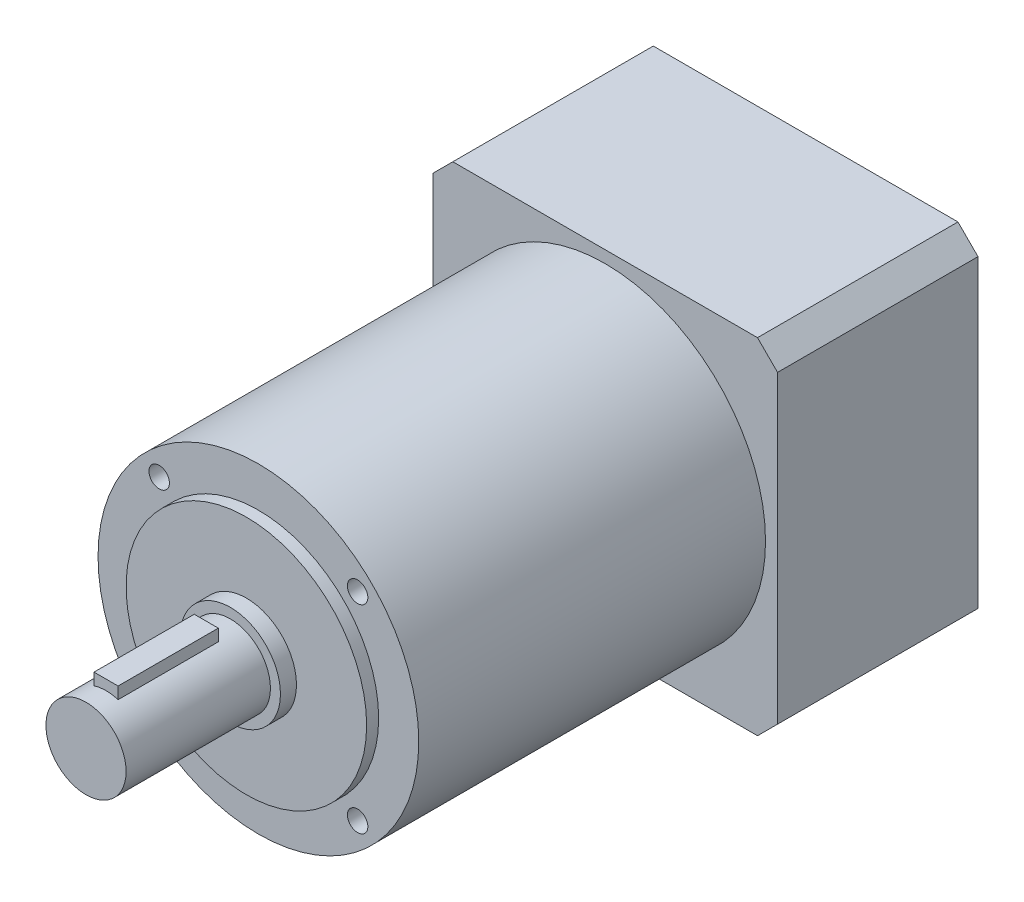
ISO-10303-21;
HEADER;
FILE_DESCRIPTION(('STEP AP214'),'2;1');
FILE_NAME('part.step','',(''),(''),'','','');
FILE_SCHEMA(('AUTOMOTIVE_DESIGN { 1 0 10303 214 1 1 1 1 }'));
ENDSEC;
DATA;
#1=APPLICATION_CONTEXT('core data for automotive mechanical design processes');
#2=APPLICATION_PROTOCOL_DEFINITION('international standard','automotive_design',2000,#1);
#3=PRODUCT_CONTEXT('',#1,'mechanical');
#4=PRODUCT('Part','Part','',(#3));
#5=PRODUCT_RELATED_PRODUCT_CATEGORY('part','',(#4));
#6=PRODUCT_DEFINITION_FORMATION('','',#4);
#7=PRODUCT_DEFINITION_CONTEXT('part definition',#1,'design');
#8=PRODUCT_DEFINITION('design','',#6,#7);
#9=PRODUCT_DEFINITION_SHAPE('','',#8);
#10=(LENGTH_UNIT() NAMED_UNIT(*) SI_UNIT(.MILLI.,.METRE.));
#11=(NAMED_UNIT(*) PLANE_ANGLE_UNIT() SI_UNIT($,.RADIAN.));
#12=(NAMED_UNIT(*) SI_UNIT($,.STERADIAN.) SOLID_ANGLE_UNIT());
#13=UNCERTAINTY_MEASURE_WITH_UNIT(LENGTH_MEASURE(1.E-05),#10,'distance_accuracy_value','');
#14=(GEOMETRIC_REPRESENTATION_CONTEXT(3) GLOBAL_UNCERTAINTY_ASSIGNED_CONTEXT((#13)) GLOBAL_UNIT_ASSIGNED_CONTEXT((#10,
#11,#12)) REPRESENTATION_CONTEXT('',''));
#15=CARTESIAN_POINT('',(0.,0.,0.));
#16=DIRECTION('',(0.,0.,1.));
#17=DIRECTION('',(1.,0.,0.));
#18=AXIS2_PLACEMENT_3D('',#15,#16,#17);
#19=CARTESIAN_POINT('',(0.,0.,179.5));
#20=DIRECTION('',(0.,0.,-1.));
#21=DIRECTION('',(-1.,0.,0.));
#22=AXIS2_PLACEMENT_3D('',#19,#20,#21);
#23=CYLINDRICAL_SURFACE('',#22,10.);
#24=CARTESIAN_POINT('',(0.,0.,143.5));
#25=DIRECTION('',(0.,0.,1.));
#26=DIRECTION('',(1.,0.,0.));
#27=AXIS2_PLACEMENT_3D('',#24,#25,#26);
#28=CIRCLE('',#27,10.);
#29=CARTESIAN_POINT('',(10.,0.,143.5));
#30=VERTEX_POINT('',#29);
#31=EDGE_CURVE('E149',#30,#30,#28,.T.);
#32=ORIENTED_EDGE('',*,*,#31,.T.);
#33=EDGE_LOOP('',(#32));
#34=FACE_BOUND('',#33,.T.);
#35=CARTESIAN_POINT('',(0.,0.,179.5));
#36=DIRECTION('',(0.,0.,1.));
#37=DIRECTION('',(1.,0.,0.));
#38=AXIS2_PLACEMENT_3D('',#35,#36,#37);
#39=CIRCLE('',#38,10.);
#40=CARTESIAN_POINT('',(10.,0.,179.5));
#41=VERTEX_POINT('',#40);
#42=EDGE_CURVE('E152',#41,#41,#39,.T.);
#43=ORIENTED_EDGE('',*,*,#42,.F.);
#44=EDGE_LOOP('',(#43));
#45=FACE_BOUND('',#44,.T.);
#46=DIRECTION('',(0.,0.,-1.));
#47=VECTOR('',#46,1.);
#48=CARTESIAN_POINT('',(-3.,9.53939201416946,179.5));
#49=LINE('',#48,#47);
#50=CARTESIAN_POINT('',(-3.,9.53939201416946,149.5));
#51=VERTEX_POINT('',#50);
#52=CARTESIAN_POINT('',(-3.,9.53939201416946,174.5));
#53=VERTEX_POINT('',#52);
#54=EDGE_CURVE('E148',#51,#53,#49,.F.);
#55=ORIENTED_EDGE('',*,*,#54,.F.);
#56=CARTESIAN_POINT('',(0.,0.,149.5));
#57=DIRECTION('',(0.,0.,1.));
#58=DIRECTION('',(1.,0.,0.));
#59=AXIS2_PLACEMENT_3D('',#56,#57,#58);
#60=CIRCLE('',#59,10.);
#61=CARTESIAN_POINT('',(3.,9.53939201416946,149.5));
#62=VERTEX_POINT('',#61);
#63=EDGE_CURVE('E190',#62,#51,#60,.T.);
#64=ORIENTED_EDGE('',*,*,#63,.F.);
#65=DIRECTION('',(0.,0.,-1.));
#66=VECTOR('',#65,1.);
#67=CARTESIAN_POINT('',(3.,9.53939201416946,179.5));
#68=LINE('',#67,#66);
#69=CARTESIAN_POINT('',(3.,9.53939201416946,174.5));
#70=VERTEX_POINT('',#69);
#71=EDGE_CURVE('E202',#70,#62,#68,.T.);
#72=ORIENTED_EDGE('',*,*,#71,.F.);
#73=CARTESIAN_POINT('',(0.,0.,174.5));
#74=DIRECTION('',(0.,0.,-1.));
#75=DIRECTION('',(-1.,0.,0.));
#76=AXIS2_PLACEMENT_3D('',#73,#74,#75);
#77=CIRCLE('',#76,10.);
#78=EDGE_CURVE('E205',#53,#70,#77,.T.);
#79=ORIENTED_EDGE('',*,*,#78,.F.);
#80=EDGE_LOOP('',(#55,#64,#72,#79));
#81=FACE_BOUND('',#80,.T.);
#82=ADVANCED_FACE('F34',(#34,#45,#81),#23,.T.);
#83=CARTESIAN_POINT('',(0.,0.,143.5));
#84=DIRECTION('',(0.,0.,1.));
#85=DIRECTION('',(1.,0.,0.));
#86=AXIS2_PLACEMENT_3D('',#83,#84,#85);
#87=PLANE('',#86);
#88=CARTESIAN_POINT('',(0.,0.,143.5));
#89=DIRECTION('',(0.,0.,1.));
#90=DIRECTION('',(1.,0.,0.));
#91=AXIS2_PLACEMENT_3D('',#88,#89,#90);
#92=CIRCLE('',#91,12.5);
#93=CARTESIAN_POINT('',(12.5,0.,143.5));
#94=VERTEX_POINT('',#93);
#95=EDGE_CURVE('E161',#94,#94,#92,.T.);
#96=ORIENTED_EDGE('',*,*,#95,.T.);
#97=EDGE_LOOP('',(#96));
#98=FACE_BOUND('',#97,.T.);
#99=ORIENTED_EDGE('',*,*,#31,.F.);
#100=EDGE_LOOP('',(#99));
#101=FACE_BOUND('',#100,.T.);
#102=ADVANCED_FACE('F282',(#98,#101),#87,.T.);
#103=CARTESIAN_POINT('',(0.,0.,139.5));
#104=DIRECTION('',(0.,0.,1.));
#105=DIRECTION('',(1.,0.,0.));
#106=AXIS2_PLACEMENT_3D('',#103,#104,#105);
#107=PLANE('',#106);
#108=CARTESIAN_POINT('',(0.,0.,139.5));
#109=DIRECTION('',(0.,0.,1.));
#110=DIRECTION('',(1.,0.,0.));
#111=AXIS2_PLACEMENT_3D('',#108,#109,#110);
#112=CIRCLE('',#111,30.);
#113=CARTESIAN_POINT('',(30.,0.,139.5));
#114=VERTEX_POINT('',#113);
#115=EDGE_CURVE('E167',#114,#114,#112,.T.);
#116=ORIENTED_EDGE('',*,*,#115,.T.);
#117=EDGE_LOOP('',(#116));
#118=FACE_BOUND('',#117,.T.);
#119=CARTESIAN_POINT('',(0.,0.,139.5));
#120=DIRECTION('',(0.,0.,1.));
#121=DIRECTION('',(1.,0.,0.));
#122=AXIS2_PLACEMENT_3D('',#119,#120,#121);
#123=CIRCLE('',#122,12.5);
#124=CARTESIAN_POINT('',(12.5,0.,139.5));
#125=VERTEX_POINT('',#124);
#126=EDGE_CURVE('E159',#125,#125,#123,.T.);
#127=ORIENTED_EDGE('',*,*,#126,.F.);
#128=EDGE_LOOP('',(#127));
#129=FACE_BOUND('',#128,.T.);
#130=ADVANCED_FACE('F288',(#118,#129),#107,.T.);
#131=CARTESIAN_POINT('',(0.,0.,136.5));
#132=DIRECTION('',(0.,0.,1.));
#133=DIRECTION('',(1.,0.,0.));
#134=AXIS2_PLACEMENT_3D('',#131,#132,#133);
#135=PLANE('',#134);
#136=CARTESIAN_POINT('',(-24.7487373415292,-24.7487373415292,136.5));
#137=DIRECTION('',(0.,0.,1.));
#138=DIRECTION('',(1.,0.,0.));
#139=AXIS2_PLACEMENT_3D('',#136,#137,#138);
#140=CIRCLE('',#139,2.55);
#141=CARTESIAN_POINT('',(-22.1987373415292,-24.7487373415292,136.5));
#142=VERTEX_POINT('',#141);
#143=EDGE_CURVE('E561',#142,#142,#140,.T.);
#144=ORIENTED_EDGE('',*,*,#143,.F.);
#145=EDGE_LOOP('',(#144));
#146=FACE_BOUND('',#145,.T.);
#147=CARTESIAN_POINT('',(24.7487373415292,-24.7487373415292,136.5));
#148=DIRECTION('',(0.,0.,1.));
#149=DIRECTION('',(1.,0.,0.));
#150=AXIS2_PLACEMENT_3D('',#147,#148,#149);
#151=CIRCLE('',#150,2.55);
#152=CARTESIAN_POINT('',(27.2987373415292,-24.7487373415292,136.5));
#153=VERTEX_POINT('',#152);
#154=EDGE_CURVE('E555',#153,#153,#151,.T.);
#155=ORIENTED_EDGE('',*,*,#154,.F.);
#156=EDGE_LOOP('',(#155));
#157=FACE_BOUND('',#156,.T.);
#158=CARTESIAN_POINT('',(24.7487373415292,24.7487373415292,136.5));
#159=DIRECTION('',(0.,0.,1.));
#160=DIRECTION('',(1.,0.,0.));
#161=AXIS2_PLACEMENT_3D('',#158,#159,#160);
#162=CIRCLE('',#161,2.55);
#163=CARTESIAN_POINT('',(27.2987373415292,24.7487373415292,136.5));
#164=VERTEX_POINT('',#163);
#165=EDGE_CURVE('E549',#164,#164,#162,.T.);
#166=ORIENTED_EDGE('',*,*,#165,.F.);
#167=EDGE_LOOP('',(#166));
#168=FACE_BOUND('',#167,.T.);
#169=CARTESIAN_POINT('',(-24.7487373415292,24.7487373415292,136.5));
#170=DIRECTION('',(0.,0.,1.));
#171=DIRECTION('',(1.,0.,0.));
#172=AXIS2_PLACEMENT_3D('',#169,#170,#171);
#173=CIRCLE('',#172,2.55);
#174=CARTESIAN_POINT('',(-22.1987373415292,24.7487373415292,136.5));
#175=VERTEX_POINT('',#174);
#176=EDGE_CURVE('E543',#175,#175,#173,.T.);
#177=ORIENTED_EDGE('',*,*,#176,.F.);
#178=EDGE_LOOP('',(#177));
#179=FACE_BOUND('',#178,.T.);
#180=CARTESIAN_POINT('',(0.,0.,136.5));
#181=DIRECTION('',(0.,0.,1.));
#182=DIRECTION('',(1.,0.,0.));
#183=AXIS2_PLACEMENT_3D('',#180,#181,#182);
#184=CIRCLE('',#183,40.);
#185=CARTESIAN_POINT('',(40.,0.,136.5));
#186=VERTEX_POINT('',#185);
#187=EDGE_CURVE('E173',#186,#186,#184,.T.);
#188=ORIENTED_EDGE('',*,*,#187,.T.);
#189=EDGE_LOOP('',(#188));
#190=FACE_BOUND('',#189,.T.);
#191=CARTESIAN_POINT('',(0.,0.,136.5));
#192=DIRECTION('',(0.,0.,1.));
#193=DIRECTION('',(1.,0.,0.));
#194=AXIS2_PLACEMENT_3D('',#191,#192,#193);
#195=CIRCLE('',#194,30.);
#196=CARTESIAN_POINT('',(30.,0.,136.5));
#197=VERTEX_POINT('',#196);
#198=EDGE_CURVE('E164',#197,#197,#195,.T.);
#199=ORIENTED_EDGE('',*,*,#198,.F.);
#200=EDGE_LOOP('',(#199));
#201=FACE_BOUND('',#200,.T.);
#202=ADVANCED_FACE('F303',(#146,#157,#168,#179,#190,#201),#135,.T.);
#203=CARTESIAN_POINT('',(0.,0.,50.));
#204=DIRECTION('',(0.,0.,1.));
#205=DIRECTION('',(1.,0.,0.));
#206=AXIS2_PLACEMENT_3D('',#203,#204,#205);
#207=PLANE('',#206);
#208=DIRECTION('',(1.,0.,0.));
#209=VECTOR('',#208,1.);
#210=CARTESIAN_POINT('',(43.,-43.,50.));
#211=LINE('',#210,#209);
#212=CARTESIAN_POINT('',(-38.,-43.,50.));
#213=VERTEX_POINT('',#212);
#214=CARTESIAN_POINT('',(38.,-43.,50.));
#215=VERTEX_POINT('',#214);
#216=EDGE_CURVE('E182',#213,#215,#211,.T.);
#217=ORIENTED_EDGE('',*,*,#216,.T.);
#218=DIRECTION('',(-0.707106781186549,-0.707106781186546,0.));
#219=VECTOR('',#218,1.);
#220=CARTESIAN_POINT('',(40.4999999999999,-40.5000000000001,50.));
#221=LINE('',#220,#219);
#222=CARTESIAN_POINT('',(43.,-38.,50.));
#223=VERTEX_POINT('',#222);
#224=EDGE_CURVE('E231',#215,#223,#221,.F.);
#225=ORIENTED_EDGE('',*,*,#224,.T.);
#226=DIRECTION('',(0.,1.,0.));
#227=VECTOR('',#226,1.);
#228=CARTESIAN_POINT('',(43.,-43.,50.));
#229=LINE('',#228,#227);
#230=CARTESIAN_POINT('',(43.,38.,50.));
#231=VERTEX_POINT('',#230);
#232=EDGE_CURVE('E186',#223,#231,#229,.T.);
#233=ORIENTED_EDGE('',*,*,#232,.T.);
#234=DIRECTION('',(0.707106781186546,-0.707106781186549,0.));
#235=VECTOR('',#234,1.);
#236=CARTESIAN_POINT('',(40.5000000000001,40.4999999999999,50.));
#237=LINE('',#236,#235);
#238=CARTESIAN_POINT('',(38.,43.,50.));
#239=VERTEX_POINT('',#238);
#240=EDGE_CURVE('E55',#231,#239,#237,.F.);
#241=ORIENTED_EDGE('',*,*,#240,.T.);
#242=DIRECTION('',(-1.,0.,0.));
#243=VECTOR('',#242,1.);
#244=CARTESIAN_POINT('',(43.,43.,50.));
#245=LINE('',#244,#243);
#246=CARTESIAN_POINT('',(-38.,43.,50.));
#247=VERTEX_POINT('',#246);
#248=EDGE_CURVE('E188',#239,#247,#245,.T.);
#249=ORIENTED_EDGE('',*,*,#248,.T.);
#250=DIRECTION('',(0.707106781186549,0.707106781186546,0.));
#251=VECTOR('',#250,1.);
#252=CARTESIAN_POINT('',(-40.4999999999999,40.5000000000001,50.));
#253=LINE('',#252,#251);
#254=CARTESIAN_POINT('',(-43.,38.,50.));
#255=VERTEX_POINT('',#254);
#256=EDGE_CURVE('E226',#247,#255,#253,.F.);
#257=ORIENTED_EDGE('',*,*,#256,.T.);
#258=DIRECTION('',(0.,-1.,0.));
#259=VECTOR('',#258,1.);
#260=CARTESIAN_POINT('',(-43.,-43.,50.));
#261=LINE('',#260,#259);
#262=CARTESIAN_POINT('',(-43.,-38.,50.));
#263=VERTEX_POINT('',#262);
#264=EDGE_CURVE('E179',#255,#263,#261,.T.);
#265=ORIENTED_EDGE('',*,*,#264,.T.);
#266=DIRECTION('',(-0.707106781186548,0.707106781186548,0.));
#267=VECTOR('',#266,1.);
#268=CARTESIAN_POINT('',(-40.5,-40.5,50.));
#269=LINE('',#268,#267);
#270=EDGE_CURVE('E229',#263,#213,#269,.F.);
#271=ORIENTED_EDGE('',*,*,#270,.T.);
#272=EDGE_LOOP('',(#217,#225,#233,#241,#249,#257,#265,#271));
#273=FACE_BOUND('',#272,.T.);
#274=CARTESIAN_POINT('',(0.,0.,50.));
#275=DIRECTION('',(0.,0.,1.));
#276=DIRECTION('',(1.,0.,0.));
#277=AXIS2_PLACEMENT_3D('',#274,#275,#276);
#278=CIRCLE('',#277,40.);
#279=CARTESIAN_POINT('',(40.,0.,50.));
#280=VERTEX_POINT('',#279);
#281=EDGE_CURVE('E170',#280,#280,#278,.T.);
#282=ORIENTED_EDGE('',*,*,#281,.F.);
#283=EDGE_LOOP('',(#282));
#284=FACE_BOUND('',#283,.T.);
#285=ADVANCED_FACE('F245',(#273,#284),#207,.T.);
#286=CARTESIAN_POINT('',(-43.,-43.,50.));
#287=DIRECTION('',(1.,0.,0.));
#288=DIRECTION('',(0.,0.,-1.));
#289=AXIS2_PLACEMENT_3D('',#286,#287,#288);
#290=PLANE('',#289);
#291=DIRECTION('',(0.,-1.,0.));
#292=VECTOR('',#291,1.);
#293=CARTESIAN_POINT('',(-43.,-43.,0.));
#294=LINE('',#293,#292);
#295=CARTESIAN_POINT('',(-43.,38.,0.));
#296=VERTEX_POINT('',#295);
#297=CARTESIAN_POINT('',(-43.,-38.,0.));
#298=VERTEX_POINT('',#297);
#299=EDGE_CURVE('E176',#296,#298,#294,.T.);
#300=ORIENTED_EDGE('',*,*,#299,.T.);
#301=DIRECTION('',(0.,0.,1.));
#302=VECTOR('',#301,1.);
#303=CARTESIAN_POINT('',(-43.,-38.,50.));
#304=LINE('',#303,#302);
#305=EDGE_CURVE('E236',#298,#263,#304,.T.);
#306=ORIENTED_EDGE('',*,*,#305,.T.);
#307=ORIENTED_EDGE('',*,*,#264,.F.);
#308=DIRECTION('',(0.,0.,-1.));
#309=VECTOR('',#308,1.);
#310=CARTESIAN_POINT('',(-43.,38.,50.));
#311=LINE('',#310,#309);
#312=EDGE_CURVE('E233',#255,#296,#311,.T.);
#313=ORIENTED_EDGE('',*,*,#312,.T.);
#314=EDGE_LOOP('',(#300,#306,#307,#313));
#315=FACE_BOUND('',#314,.T.);
#316=ADVANCED_FACE('F240',(#315),#290,.F.);
#317=CARTESIAN_POINT('',(43.,-43.,50.));
#318=DIRECTION('',(0.,1.,0.));
#319=DIRECTION('',(-1.,0.,0.));
#320=AXIS2_PLACEMENT_3D('',#317,#318,#319);
#321=PLANE('',#320);
#322=DIRECTION('',(1.,0.,0.));
#323=VECTOR('',#322,1.);
#324=CARTESIAN_POINT('',(43.,-43.,0.));
#325=LINE('',#324,#323);
#326=CARTESIAN_POINT('',(-38.,-43.,0.));
#327=VERTEX_POINT('',#326);
#328=CARTESIAN_POINT('',(38.,-43.,0.));
#329=VERTEX_POINT('',#328);
#330=EDGE_CURVE('E193',#327,#329,#325,.T.);
#331=ORIENTED_EDGE('',*,*,#330,.T.);
#332=DIRECTION('',(0.,0.,1.));
#333=VECTOR('',#332,1.);
#334=CARTESIAN_POINT('',(38.,-43.,50.));
#335=LINE('',#334,#333);
#336=EDGE_CURVE('E224',#329,#215,#335,.T.);
#337=ORIENTED_EDGE('',*,*,#336,.T.);
#338=ORIENTED_EDGE('',*,*,#216,.F.);
#339=DIRECTION('',(0.,0.,-1.));
#340=VECTOR('',#339,1.);
#341=CARTESIAN_POINT('',(-38.,-43.,50.));
#342=LINE('',#341,#340);
#343=EDGE_CURVE('E221',#213,#327,#342,.T.);
#344=ORIENTED_EDGE('',*,*,#343,.T.);
#345=EDGE_LOOP('',(#331,#337,#338,#344));
#346=FACE_BOUND('',#345,.T.);
#347=ADVANCED_FACE('F253',(#346),#321,.F.);
#348=CARTESIAN_POINT('',(43.,-43.,50.));
#349=DIRECTION('',(-1.,0.,0.));
#350=DIRECTION('',(0.,0.,1.));
#351=AXIS2_PLACEMENT_3D('',#348,#349,#350);
#352=PLANE('',#351);
#353=ORIENTED_EDGE('',*,*,#232,.F.);
#354=DIRECTION('',(0.,0.,-1.));
#355=VECTOR('',#354,1.);
#356=CARTESIAN_POINT('',(43.,-38.,50.));
#357=LINE('',#356,#355);
#358=CARTESIAN_POINT('',(43.,-38.,0.));
#359=VERTEX_POINT('',#358);
#360=EDGE_CURVE('E210',#223,#359,#357,.T.);
#361=ORIENTED_EDGE('',*,*,#360,.T.);
#362=DIRECTION('',(0.,1.,0.));
#363=VECTOR('',#362,1.);
#364=CARTESIAN_POINT('',(43.,-43.,0.));
#365=LINE('',#364,#363);
#366=CARTESIAN_POINT('',(43.,38.,0.));
#367=VERTEX_POINT('',#366);
#368=EDGE_CURVE('E196',#359,#367,#365,.T.);
#369=ORIENTED_EDGE('',*,*,#368,.T.);
#370=DIRECTION('',(0.,0.,1.));
#371=VECTOR('',#370,1.);
#372=CARTESIAN_POINT('',(43.,38.,50.));
#373=LINE('',#372,#371);
#374=EDGE_CURVE('E208',#367,#231,#373,.T.);
#375=ORIENTED_EDGE('',*,*,#374,.T.);
#376=EDGE_LOOP('',(#353,#361,#369,#375));
#377=FACE_BOUND('',#376,.T.);
#378=ADVANCED_FACE('F264',(#377),#352,.F.);
#379=CARTESIAN_POINT('',(43.,43.,50.));
#380=DIRECTION('',(0.,-1.,0.));
#381=DIRECTION('',(1.,0.,0.));
#382=AXIS2_PLACEMENT_3D('',#379,#380,#381);
#383=PLANE('',#382);
#384=ORIENTED_EDGE('',*,*,#248,.F.);
#385=DIRECTION('',(0.,0.,-1.));
#386=VECTOR('',#385,1.);
#387=CARTESIAN_POINT('',(38.,43.,50.));
#388=LINE('',#387,#386);
#389=CARTESIAN_POINT('',(38.,43.,0.));
#390=VERTEX_POINT('',#389);
#391=EDGE_CURVE('E11',#239,#390,#388,.T.);
#392=ORIENTED_EDGE('',*,*,#391,.T.);
#393=DIRECTION('',(-1.,0.,0.));
#394=VECTOR('',#393,1.);
#395=CARTESIAN_POINT('',(43.,43.,0.));
#396=LINE('',#395,#394);
#397=CARTESIAN_POINT('',(-38.,43.,0.));
#398=VERTEX_POINT('',#397);
#399=EDGE_CURVE('E183',#390,#398,#396,.T.);
#400=ORIENTED_EDGE('',*,*,#399,.T.);
#401=DIRECTION('',(0.,0.,1.));
#402=VECTOR('',#401,1.);
#403=CARTESIAN_POINT('',(-38.,43.,50.));
#404=LINE('',#403,#402);
#405=EDGE_CURVE('E42',#398,#247,#404,.T.);
#406=ORIENTED_EDGE('',*,*,#405,.T.);
#407=EDGE_LOOP('',(#384,#392,#400,#406));
#408=FACE_BOUND('',#407,.T.);
#409=ADVANCED_FACE('F270',(#408),#383,.F.);
#410=CARTESIAN_POINT('',(0.,0.,0.));
#411=DIRECTION('',(0.,0.,1.));
#412=DIRECTION('',(1.,0.,0.));
#413=AXIS2_PLACEMENT_3D('',#410,#411,#412);
#414=PLANE('',#413);
#415=CARTESIAN_POINT('',(35.,-35.,0.));
#416=DIRECTION('',(0.,0.,-1.));
#417=DIRECTION('',(-1.,0.,0.));
#418=AXIS2_PLACEMENT_3D('',#415,#416,#417);
#419=CIRCLE('',#418,2.1);
#420=CARTESIAN_POINT('',(32.9,-35.,0.));
#421=VERTEX_POINT('',#420);
#422=EDGE_CURVE('E537',#421,#421,#419,.T.);
#423=ORIENTED_EDGE('',*,*,#422,.F.);
#424=EDGE_LOOP('',(#423));
#425=FACE_BOUND('',#424,.T.);
#426=CARTESIAN_POINT('',(-35.,-35.,0.));
#427=DIRECTION('',(0.,0.,-1.));
#428=DIRECTION('',(-1.,0.,0.));
#429=AXIS2_PLACEMENT_3D('',#426,#427,#428);
#430=CIRCLE('',#429,2.1);
#431=CARTESIAN_POINT('',(-37.1,-35.,0.));
#432=VERTEX_POINT('',#431);
#433=EDGE_CURVE('E531',#432,#432,#430,.T.);
#434=ORIENTED_EDGE('',*,*,#433,.F.);
#435=EDGE_LOOP('',(#434));
#436=FACE_BOUND('',#435,.T.);
#437=CARTESIAN_POINT('',(-35.,35.,0.));
#438=DIRECTION('',(0.,0.,-1.));
#439=DIRECTION('',(-1.,0.,0.));
#440=AXIS2_PLACEMENT_3D('',#437,#438,#439);
#441=CIRCLE('',#440,2.1);
#442=CARTESIAN_POINT('',(-37.1,35.,0.));
#443=VERTEX_POINT('',#442);
#444=EDGE_CURVE('E525',#443,#443,#441,.T.);
#445=ORIENTED_EDGE('',*,*,#444,.F.);
#446=EDGE_LOOP('',(#445));
#447=FACE_BOUND('',#446,.T.);
#448=CARTESIAN_POINT('',(35.,35.,0.));
#449=DIRECTION('',(0.,0.,-1.));
#450=DIRECTION('',(-1.,0.,0.));
#451=AXIS2_PLACEMENT_3D('',#448,#449,#450);
#452=CIRCLE('',#451,2.1);
#453=CARTESIAN_POINT('',(32.9,35.,0.));
#454=VERTEX_POINT('',#453);
#455=EDGE_CURVE('E519',#454,#454,#452,.T.);
#456=ORIENTED_EDGE('',*,*,#455,.F.);
#457=EDGE_LOOP('',(#456));
#458=FACE_BOUND('',#457,.T.);
#459=CARTESIAN_POINT('',(0.,0.,0.));
#460=DIRECTION('',(0.,0.,-1.));
#461=DIRECTION('',(-1.,0.,0.));
#462=AXIS2_PLACEMENT_3D('',#459,#460,#461);
#463=CIRCLE('',#462,36.5);
#464=CARTESIAN_POINT('',(-36.5,0.,0.));
#465=VERTEX_POINT('',#464);
#466=EDGE_CURVE('E507',#465,#465,#463,.T.);
#467=ORIENTED_EDGE('',*,*,#466,.F.);
#468=EDGE_LOOP('',(#467));
#469=FACE_BOUND('',#468,.T.);
#470=ORIENTED_EDGE('',*,*,#368,.F.);
#471=DIRECTION('',(0.707106781186549,0.707106781186546,0.));
#472=VECTOR('',#471,1.);
#473=CARTESIAN_POINT('',(43.,-38.,0.));
#474=LINE('',#473,#472);
#475=EDGE_CURVE('E219',#359,#329,#474,.F.);
#476=ORIENTED_EDGE('',*,*,#475,.T.);
#477=ORIENTED_EDGE('',*,*,#330,.F.);
#478=DIRECTION('',(0.707106781186548,-0.707106781186548,0.));
#479=VECTOR('',#478,1.);
#480=CARTESIAN_POINT('',(-38.,-43.,0.));
#481=LINE('',#480,#479);
#482=EDGE_CURVE('E217',#327,#298,#481,.F.);
#483=ORIENTED_EDGE('',*,*,#482,.T.);
#484=ORIENTED_EDGE('',*,*,#299,.F.);
#485=DIRECTION('',(-0.707106781186549,-0.707106781186546,0.));
#486=VECTOR('',#485,1.);
#487=CARTESIAN_POINT('',(-43.,38.,0.));
#488=LINE('',#487,#486);
#489=EDGE_CURVE('E213',#296,#398,#488,.F.);
#490=ORIENTED_EDGE('',*,*,#489,.T.);
#491=ORIENTED_EDGE('',*,*,#399,.F.);
#492=DIRECTION('',(-0.707106781186546,0.707106781186549,0.));
#493=VECTOR('',#492,1.);
#494=CARTESIAN_POINT('',(38.,43.,0.));
#495=LINE('',#494,#493);
#496=EDGE_CURVE('E215',#390,#367,#495,.F.);
#497=ORIENTED_EDGE('',*,*,#496,.T.);
#498=EDGE_LOOP('',(#470,#476,#477,#483,#484,#490,#491,#497));
#499=FACE_BOUND('',#498,.T.);
#500=ADVANCED_FACE('F257',(#425,#436,#447,#458,#469,#499),#414,.F.);
#501=CARTESIAN_POINT('',(0.,0.,136.5));
#502=DIRECTION('',(0.,0.,-1.));
#503=DIRECTION('',(-1.,0.,0.));
#504=AXIS2_PLACEMENT_3D('',#501,#502,#503);
#505=CYLINDRICAL_SURFACE('',#504,40.);
#506=ORIENTED_EDGE('',*,*,#187,.F.);
#507=EDGE_LOOP('',(#506));
#508=FACE_BOUND('',#507,.T.);
#509=ORIENTED_EDGE('',*,*,#281,.T.);
#510=EDGE_LOOP('',(#509));
#511=FACE_BOUND('',#510,.T.);
#512=ADVANCED_FACE('F307',(#508,#511),#505,.T.);
#513=CARTESIAN_POINT('',(0.,0.,139.5));
#514=DIRECTION('',(0.,0.,-1.));
#515=DIRECTION('',(-1.,0.,0.));
#516=AXIS2_PLACEMENT_3D('',#513,#514,#515);
#517=CYLINDRICAL_SURFACE('',#516,30.);
#518=ORIENTED_EDGE('',*,*,#115,.F.);
#519=EDGE_LOOP('',(#518));
#520=FACE_BOUND('',#519,.T.);
#521=ORIENTED_EDGE('',*,*,#198,.T.);
#522=EDGE_LOOP('',(#521));
#523=FACE_BOUND('',#522,.T.);
#524=ADVANCED_FACE('F299',(#520,#523),#517,.T.);
#525=CARTESIAN_POINT('',(0.,0.,143.5));
#526=DIRECTION('',(0.,0.,-1.));
#527=DIRECTION('',(-1.,0.,0.));
#528=AXIS2_PLACEMENT_3D('',#525,#526,#527);
#529=CYLINDRICAL_SURFACE('',#528,12.5);
#530=ORIENTED_EDGE('',*,*,#95,.F.);
#531=EDGE_LOOP('',(#530));
#532=FACE_BOUND('',#531,.T.);
#533=ORIENTED_EDGE('',*,*,#126,.T.);
#534=EDGE_LOOP('',(#533));
#535=FACE_BOUND('',#534,.T.);
#536=ADVANCED_FACE('F296',(#532,#535),#529,.T.);
#537=CARTESIAN_POINT('',(0.,0.,179.5));
#538=DIRECTION('',(0.,0.,1.));
#539=DIRECTION('',(1.,0.,0.));
#540=AXIS2_PLACEMENT_3D('',#537,#538,#539);
#541=PLANE('',#540);
#542=ORIENTED_EDGE('',*,*,#42,.T.);
#543=EDGE_LOOP('',(#542));
#544=FACE_BOUND('',#543,.T.);
#545=ADVANCED_FACE('F293',(#544),#541,.T.);
#546=CARTESIAN_POINT('',(-3.,12.5,174.5));
#547=DIRECTION('',(1.,0.,0.));
#548=DIRECTION('',(0.,0.,-1.));
#549=AXIS2_PLACEMENT_3D('',#546,#547,#548);
#550=PLANE('',#549);
#551=DIRECTION('',(0.,-1.,0.));
#552=VECTOR('',#551,1.);
#553=CARTESIAN_POINT('',(-3.,12.5,149.5));
#554=LINE('',#553,#552);
#555=CARTESIAN_POINT('',(-3.,12.5,149.5));
#556=VERTEX_POINT('',#555);
#557=EDGE_CURVE('E501',#556,#51,#554,.T.);
#558=ORIENTED_EDGE('',*,*,#557,.T.);
#559=ORIENTED_EDGE('',*,*,#54,.T.);
#560=DIRECTION('',(0.,-1.,0.));
#561=VECTOR('',#560,1.);
#562=CARTESIAN_POINT('',(-3.,12.5,174.5));
#563=LINE('',#562,#561);
#564=CARTESIAN_POINT('',(-3.,12.5,174.5));
#565=VERTEX_POINT('',#564);
#566=EDGE_CURVE('E129',#565,#53,#563,.T.);
#567=ORIENTED_EDGE('',*,*,#566,.F.);
#568=DIRECTION('',(0.,0.,1.));
#569=VECTOR('',#568,1.);
#570=CARTESIAN_POINT('',(-3.,12.5,174.5));
#571=LINE('',#570,#569);
#572=EDGE_CURVE('E135',#556,#565,#571,.T.);
#573=ORIENTED_EDGE('',*,*,#572,.F.);
#574=EDGE_LOOP('',(#558,#559,#567,#573));
#575=FACE_BOUND('',#574,.T.);
#576=ADVANCED_FACE('F147',(#575),#550,.F.);
#577=CARTESIAN_POINT('',(3.,12.5,174.5));
#578=DIRECTION('',(0.,0.,-1.));
#579=DIRECTION('',(-1.,0.,0.));
#580=AXIS2_PLACEMENT_3D('',#577,#578,#579);
#581=PLANE('',#580);
#582=ORIENTED_EDGE('',*,*,#566,.T.);
#583=ORIENTED_EDGE('',*,*,#78,.T.);
#584=DIRECTION('',(0.,-1.,0.));
#585=VECTOR('',#584,1.);
#586=CARTESIAN_POINT('',(3.,12.5,174.5));
#587=LINE('',#586,#585);
#588=CARTESIAN_POINT('',(3.,12.5,174.5));
#589=VERTEX_POINT('',#588);
#590=EDGE_CURVE('E131',#589,#70,#587,.T.);
#591=ORIENTED_EDGE('',*,*,#590,.F.);
#592=DIRECTION('',(1.,0.,0.));
#593=VECTOR('',#592,1.);
#594=CARTESIAN_POINT('',(3.,12.5,174.5));
#595=LINE('',#594,#593);
#596=EDGE_CURVE('E124',#565,#589,#595,.T.);
#597=ORIENTED_EDGE('',*,*,#596,.F.);
#598=EDGE_LOOP('',(#582,#583,#591,#597));
#599=FACE_BOUND('',#598,.T.);
#600=ADVANCED_FACE('F126',(#599),#581,.F.);
#601=CARTESIAN_POINT('',(3.,12.5,174.5));
#602=DIRECTION('',(-1.,0.,0.));
#603=DIRECTION('',(0.,0.,1.));
#604=AXIS2_PLACEMENT_3D('',#601,#602,#603);
#605=PLANE('',#604);
#606=ORIENTED_EDGE('',*,*,#590,.T.);
#607=ORIENTED_EDGE('',*,*,#71,.T.);
#608=DIRECTION('',(0.,-1.,0.));
#609=VECTOR('',#608,1.);
#610=CARTESIAN_POINT('',(3.,12.5,149.5));
#611=LINE('',#610,#609);
#612=CARTESIAN_POINT('',(3.,12.5,149.5));
#613=VERTEX_POINT('',#612);
#614=EDGE_CURVE('E154',#613,#62,#611,.T.);
#615=ORIENTED_EDGE('',*,*,#614,.F.);
#616=DIRECTION('',(0.,0.,-1.));
#617=VECTOR('',#616,1.);
#618=CARTESIAN_POINT('',(3.,12.5,174.5));
#619=LINE('',#618,#617);
#620=EDGE_CURVE('E134',#589,#613,#619,.T.);
#621=ORIENTED_EDGE('',*,*,#620,.F.);
#622=EDGE_LOOP('',(#606,#607,#615,#621));
#623=FACE_BOUND('',#622,.T.);
#624=ADVANCED_FACE('F485',(#623),#605,.F.);
#625=CARTESIAN_POINT('',(3.,12.5,149.5));
#626=DIRECTION('',(0.,0.,1.));
#627=DIRECTION('',(1.,0.,0.));
#628=AXIS2_PLACEMENT_3D('',#625,#626,#627);
#629=PLANE('',#628);
#630=ORIENTED_EDGE('',*,*,#614,.T.);
#631=ORIENTED_EDGE('',*,*,#63,.T.);
#632=ORIENTED_EDGE('',*,*,#557,.F.);
#633=DIRECTION('',(-1.,0.,0.));
#634=VECTOR('',#633,1.);
#635=CARTESIAN_POINT('',(3.,12.5,149.5));
#636=LINE('',#635,#634);
#637=EDGE_CURVE('E140',#613,#556,#636,.T.);
#638=ORIENTED_EDGE('',*,*,#637,.F.);
#639=EDGE_LOOP('',(#630,#631,#632,#638));
#640=FACE_BOUND('',#639,.T.);
#641=ADVANCED_FACE('F482',(#640),#629,.F.);
#642=CARTESIAN_POINT('',(0.,12.5,0.));
#643=DIRECTION('',(0.,1.,0.));
#644=DIRECTION('',(0.,0.,1.));
#645=AXIS2_PLACEMENT_3D('',#642,#643,#644);
#646=PLANE('',#645);
#647=ORIENTED_EDGE('',*,*,#572,.T.);
#648=ORIENTED_EDGE('',*,*,#596,.T.);
#649=ORIENTED_EDGE('',*,*,#620,.T.);
#650=ORIENTED_EDGE('',*,*,#637,.T.);
#651=EDGE_LOOP('',(#647,#648,#649,#650));
#652=FACE_BOUND('',#651,.T.);
#653=ADVANCED_FACE('F138',(#652),#646,.T.);
#654=CARTESIAN_POINT('',(0.,0.,5.));
#655=DIRECTION('',(0.,0.,-1.));
#656=DIRECTION('',(-1.,0.,0.));
#657=AXIS2_PLACEMENT_3D('',#654,#655,#656);
#658=CYLINDRICAL_SURFACE('',#657,36.5);
#659=CARTESIAN_POINT('',(0.,0.,5.));
#660=DIRECTION('',(0.,0.,-1.));
#661=DIRECTION('',(-1.,0.,0.));
#662=AXIS2_PLACEMENT_3D('',#659,#660,#661);
#663=CIRCLE('',#662,36.5);
#664=CARTESIAN_POINT('',(-36.5,0.,5.));
#665=VERTEX_POINT('',#664);
#666=EDGE_CURVE('E144',#665,#665,#663,.T.);
#667=ORIENTED_EDGE('',*,*,#666,.F.);
#668=EDGE_LOOP('',(#667));
#669=FACE_BOUND('',#668,.T.);
#670=ORIENTED_EDGE('',*,*,#466,.T.);
#671=EDGE_LOOP('',(#670));
#672=FACE_BOUND('',#671,.T.);
#673=ADVANCED_FACE('F475',(#669,#672),#658,.F.);
#674=CARTESIAN_POINT('',(0.,0.,5.));
#675=DIRECTION('',(0.,0.,-1.));
#676=DIRECTION('',(-1.,0.,0.));
#677=AXIS2_PLACEMENT_3D('',#674,#675,#676);
#678=PLANE('',#677);
#679=CARTESIAN_POINT('',(0.,0.,5.));
#680=DIRECTION('',(0.,0.,-1.));
#681=DIRECTION('',(-1.,0.,0.));
#682=AXIS2_PLACEMENT_3D('',#679,#680,#681);
#683=CIRCLE('',#682,6.35);
#684=CARTESIAN_POINT('',(-6.35,0.,5.));
#685=VERTEX_POINT('',#684);
#686=EDGE_CURVE('E513',#685,#685,#683,.T.);
#687=ORIENTED_EDGE('',*,*,#686,.F.);
#688=EDGE_LOOP('',(#687));
#689=FACE_BOUND('',#688,.T.);
#690=ORIENTED_EDGE('',*,*,#666,.T.);
#691=EDGE_LOOP('',(#690));
#692=FACE_BOUND('',#691,.T.);
#693=ADVANCED_FACE('F471',(#689,#692),#678,.T.);
#694=CARTESIAN_POINT('',(0.,0.,35.));
#695=DIRECTION('',(0.,0.,-1.));
#696=DIRECTION('',(-1.,0.,0.));
#697=AXIS2_PLACEMENT_3D('',#694,#695,#696);
#698=CYLINDRICAL_SURFACE('',#697,6.35);
#699=CARTESIAN_POINT('',(0.,0.,35.));
#700=DIRECTION('',(0.,0.,-1.));
#701=DIRECTION('',(-1.,0.,0.));
#702=AXIS2_PLACEMENT_3D('',#699,#700,#701);
#703=CIRCLE('',#702,6.35);
#704=CARTESIAN_POINT('',(-6.35,0.,35.));
#705=VERTEX_POINT('',#704);
#706=EDGE_CURVE('E510',#705,#705,#703,.T.);
#707=ORIENTED_EDGE('',*,*,#706,.F.);
#708=EDGE_LOOP('',(#707));
#709=FACE_BOUND('',#708,.T.);
#710=ORIENTED_EDGE('',*,*,#686,.T.);
#711=EDGE_LOOP('',(#710));
#712=FACE_BOUND('',#711,.T.);
#713=ADVANCED_FACE('F467',(#709,#712),#698,.F.);
#714=CARTESIAN_POINT('',(0.,0.,35.));
#715=DIRECTION('',(0.,0.,-1.));
#716=DIRECTION('',(-1.,0.,0.));
#717=AXIS2_PLACEMENT_3D('',#714,#715,#716);
#718=PLANE('',#717);
#719=ORIENTED_EDGE('',*,*,#706,.T.);
#720=EDGE_LOOP('',(#719));
#721=FACE_BOUND('',#720,.T.);
#722=ADVANCED_FACE('F463',(#721),#718,.T.);
#723=CARTESIAN_POINT('',(35.,35.,15.));
#724=DIRECTION('',(0.,0.,-1.));
#725=DIRECTION('',(-1.,0.,0.));
#726=AXIS2_PLACEMENT_3D('',#723,#724,#725);
#727=CYLINDRICAL_SURFACE('',#726,2.1);
#728=CARTESIAN_POINT('',(35.,35.,15.));
#729=DIRECTION('',(0.,0.,-1.));
#730=DIRECTION('',(-1.,0.,0.));
#731=AXIS2_PLACEMENT_3D('',#728,#729,#730);
#732=CIRCLE('',#731,2.1);
#733=CARTESIAN_POINT('',(32.9,35.,15.));
#734=VERTEX_POINT('',#733);
#735=EDGE_CURVE('E516',#734,#734,#732,.T.);
#736=ORIENTED_EDGE('',*,*,#735,.F.);
#737=EDGE_LOOP('',(#736));
#738=FACE_BOUND('',#737,.T.);
#739=ORIENTED_EDGE('',*,*,#455,.T.);
#740=EDGE_LOOP('',(#739));
#741=FACE_BOUND('',#740,.T.);
#742=ADVANCED_FACE('F459',(#738,#741),#727,.F.);
#743=CARTESIAN_POINT('',(35.,35.,15.));
#744=DIRECTION('',(0.,0.,-1.));
#745=DIRECTION('',(-1.,0.,0.));
#746=AXIS2_PLACEMENT_3D('',#743,#744,#745);
#747=PLANE('',#746);
#748=ORIENTED_EDGE('',*,*,#735,.T.);
#749=EDGE_LOOP('',(#748));
#750=FACE_BOUND('',#749,.T.);
#751=ADVANCED_FACE('F455',(#750),#747,.T.);
#752=CARTESIAN_POINT('',(-35.,35.,15.));
#753=DIRECTION('',(0.,0.,-1.));
#754=DIRECTION('',(-1.,0.,0.));
#755=AXIS2_PLACEMENT_3D('',#752,#753,#754);
#756=CYLINDRICAL_SURFACE('',#755,2.1);
#757=CARTESIAN_POINT('',(-35.,35.,15.));
#758=DIRECTION('',(0.,0.,-1.));
#759=DIRECTION('',(-1.,0.,0.));
#760=AXIS2_PLACEMENT_3D('',#757,#758,#759);
#761=CIRCLE('',#760,2.1);
#762=CARTESIAN_POINT('',(-37.1,35.,15.));
#763=VERTEX_POINT('',#762);
#764=EDGE_CURVE('E522',#763,#763,#761,.T.);
#765=ORIENTED_EDGE('',*,*,#764,.F.);
#766=EDGE_LOOP('',(#765));
#767=FACE_BOUND('',#766,.T.);
#768=ORIENTED_EDGE('',*,*,#444,.T.);
#769=EDGE_LOOP('',(#768));
#770=FACE_BOUND('',#769,.T.);
#771=ADVANCED_FACE('F451',(#767,#770),#756,.F.);
#772=CARTESIAN_POINT('',(-35.,35.,15.));
#773=DIRECTION('',(0.,0.,-1.));
#774=DIRECTION('',(-1.,0.,0.));
#775=AXIS2_PLACEMENT_3D('',#772,#773,#774);
#776=PLANE('',#775);
#777=ORIENTED_EDGE('',*,*,#764,.T.);
#778=EDGE_LOOP('',(#777));
#779=FACE_BOUND('',#778,.T.);
#780=ADVANCED_FACE('F447',(#779),#776,.T.);
#781=CARTESIAN_POINT('',(-35.,-35.,15.));
#782=DIRECTION('',(0.,0.,-1.));
#783=DIRECTION('',(-1.,0.,0.));
#784=AXIS2_PLACEMENT_3D('',#781,#782,#783);
#785=CYLINDRICAL_SURFACE('',#784,2.1);
#786=CARTESIAN_POINT('',(-35.,-35.,15.));
#787=DIRECTION('',(0.,0.,-1.));
#788=DIRECTION('',(-1.,0.,0.));
#789=AXIS2_PLACEMENT_3D('',#786,#787,#788);
#790=CIRCLE('',#789,2.1);
#791=CARTESIAN_POINT('',(-37.1,-35.,15.));
#792=VERTEX_POINT('',#791);
#793=EDGE_CURVE('E528',#792,#792,#790,.T.);
#794=ORIENTED_EDGE('',*,*,#793,.F.);
#795=EDGE_LOOP('',(#794));
#796=FACE_BOUND('',#795,.T.);
#797=ORIENTED_EDGE('',*,*,#433,.T.);
#798=EDGE_LOOP('',(#797));
#799=FACE_BOUND('',#798,.T.);
#800=ADVANCED_FACE('F443',(#796,#799),#785,.F.);
#801=CARTESIAN_POINT('',(-35.,-35.,15.));
#802=DIRECTION('',(0.,0.,-1.));
#803=DIRECTION('',(-1.,0.,0.));
#804=AXIS2_PLACEMENT_3D('',#801,#802,#803);
#805=PLANE('',#804);
#806=ORIENTED_EDGE('',*,*,#793,.T.);
#807=EDGE_LOOP('',(#806));
#808=FACE_BOUND('',#807,.T.);
#809=ADVANCED_FACE('F439',(#808),#805,.T.);
#810=CARTESIAN_POINT('',(35.,-35.,15.));
#811=DIRECTION('',(0.,0.,-1.));
#812=DIRECTION('',(-1.,0.,0.));
#813=AXIS2_PLACEMENT_3D('',#810,#811,#812);
#814=CYLINDRICAL_SURFACE('',#813,2.1);
#815=CARTESIAN_POINT('',(35.,-35.,15.));
#816=DIRECTION('',(0.,0.,-1.));
#817=DIRECTION('',(-1.,0.,0.));
#818=AXIS2_PLACEMENT_3D('',#815,#816,#817);
#819=CIRCLE('',#818,2.1);
#820=CARTESIAN_POINT('',(32.9,-35.,15.));
#821=VERTEX_POINT('',#820);
#822=EDGE_CURVE('E534',#821,#821,#819,.T.);
#823=ORIENTED_EDGE('',*,*,#822,.F.);
#824=EDGE_LOOP('',(#823));
#825=FACE_BOUND('',#824,.T.);
#826=ORIENTED_EDGE('',*,*,#422,.T.);
#827=EDGE_LOOP('',(#826));
#828=FACE_BOUND('',#827,.T.);
#829=ADVANCED_FACE('F435',(#825,#828),#814,.F.);
#830=CARTESIAN_POINT('',(35.,-35.,15.));
#831=DIRECTION('',(0.,0.,-1.));
#832=DIRECTION('',(-1.,0.,0.));
#833=AXIS2_PLACEMENT_3D('',#830,#831,#832);
#834=PLANE('',#833);
#835=ORIENTED_EDGE('',*,*,#822,.T.);
#836=EDGE_LOOP('',(#835));
#837=FACE_BOUND('',#836,.T.);
#838=ADVANCED_FACE('F330',(#837),#834,.T.);
#839=CARTESIAN_POINT('',(43.,-38.,50.));
#840=DIRECTION('',(-0.707106781186546,0.707106781186549,0.));
#841=DIRECTION('',(0.,0.,-1.));
#842=AXIS2_PLACEMENT_3D('',#839,#840,#841);
#843=PLANE('',#842);
#844=ORIENTED_EDGE('',*,*,#224,.F.);
#845=ORIENTED_EDGE('',*,*,#336,.F.);
#846=ORIENTED_EDGE('',*,*,#475,.F.);
#847=ORIENTED_EDGE('',*,*,#360,.F.);
#848=EDGE_LOOP('',(#844,#845,#846,#847));
#849=FACE_BOUND('',#848,.T.);
#850=ADVANCED_FACE('F261',(#849),#843,.F.);
#851=CARTESIAN_POINT('',(-38.,-43.,50.));
#852=DIRECTION('',(0.707106781186547,0.707106781186547,0.));
#853=DIRECTION('',(0.,0.,-1.));
#854=AXIS2_PLACEMENT_3D('',#851,#852,#853);
#855=PLANE('',#854);
#856=ORIENTED_EDGE('',*,*,#270,.F.);
#857=ORIENTED_EDGE('',*,*,#305,.F.);
#858=ORIENTED_EDGE('',*,*,#482,.F.);
#859=ORIENTED_EDGE('',*,*,#343,.F.);
#860=EDGE_LOOP('',(#856,#857,#858,#859));
#861=FACE_BOUND('',#860,.T.);
#862=ADVANCED_FACE('F250',(#861),#855,.F.);
#863=CARTESIAN_POINT('',(38.,43.,50.));
#864=DIRECTION('',(-0.707106781186549,-0.707106781186546,0.));
#865=DIRECTION('',(0.,0.,-1.));
#866=AXIS2_PLACEMENT_3D('',#863,#864,#865);
#867=PLANE('',#866);
#868=ORIENTED_EDGE('',*,*,#240,.F.);
#869=ORIENTED_EDGE('',*,*,#374,.F.);
#870=ORIENTED_EDGE('',*,*,#496,.F.);
#871=ORIENTED_EDGE('',*,*,#391,.F.);
#872=EDGE_LOOP('',(#868,#869,#870,#871));
#873=FACE_BOUND('',#872,.T.);
#874=ADVANCED_FACE('F268',(#873),#867,.F.);
#875=CARTESIAN_POINT('',(-43.,38.,50.));
#876=DIRECTION('',(0.707106781186546,-0.707106781186549,0.));
#877=DIRECTION('',(0.,0.,-1.));
#878=AXIS2_PLACEMENT_3D('',#875,#876,#877);
#879=PLANE('',#878);
#880=ORIENTED_EDGE('',*,*,#256,.F.);
#881=ORIENTED_EDGE('',*,*,#405,.F.);
#882=ORIENTED_EDGE('',*,*,#489,.F.);
#883=ORIENTED_EDGE('',*,*,#312,.F.);
#884=EDGE_LOOP('',(#880,#881,#882,#883));
#885=FACE_BOUND('',#884,.T.);
#886=ADVANCED_FACE('F36',(#885),#879,.F.);
#887=CARTESIAN_POINT('',(-24.7487373415292,24.7487373415292,121.5));
#888=DIRECTION('',(0.,0.,1.));
#889=DIRECTION('',(1.,0.,0.));
#890=AXIS2_PLACEMENT_3D('',#887,#888,#889);
#891=CYLINDRICAL_SURFACE('',#890,2.55);
#892=CARTESIAN_POINT('',(-24.7487373415292,24.7487373415292,121.5));
#893=DIRECTION('',(0.,0.,1.));
#894=DIRECTION('',(1.,0.,0.));
#895=AXIS2_PLACEMENT_3D('',#892,#893,#894);
#896=CIRCLE('',#895,2.55);
#897=CARTESIAN_POINT('',(-22.1987373415292,24.7487373415292,121.5));
#898=VERTEX_POINT('',#897);
#899=EDGE_CURVE('E540',#898,#898,#896,.T.);
#900=ORIENTED_EDGE('',*,*,#899,.F.);
#901=EDGE_LOOP('',(#900));
#902=FACE_BOUND('',#901,.T.);
#903=ORIENTED_EDGE('',*,*,#176,.T.);
#904=EDGE_LOOP('',(#903));
#905=FACE_BOUND('',#904,.T.);
#906=ADVANCED_FACE('F273',(#902,#905),#891,.F.);
#907=CARTESIAN_POINT('',(-24.7487373415292,24.7487373415292,121.5));
#908=DIRECTION('',(0.,0.,1.));
#909=DIRECTION('',(1.,0.,0.));
#910=AXIS2_PLACEMENT_3D('',#907,#908,#909);
#911=PLANE('',#910);
#912=ORIENTED_EDGE('',*,*,#899,.T.);
#913=EDGE_LOOP('',(#912));
#914=FACE_BOUND('',#913,.T.);
#915=ADVANCED_FACE('F278',(#914),#911,.T.);
#916=CARTESIAN_POINT('',(24.7487373415292,24.7487373415292,121.5));
#917=DIRECTION('',(0.,0.,1.));
#918=DIRECTION('',(1.,0.,0.));
#919=AXIS2_PLACEMENT_3D('',#916,#917,#918);
#920=CYLINDRICAL_SURFACE('',#919,2.55);
#921=CARTESIAN_POINT('',(24.7487373415292,24.7487373415292,121.5));
#922=DIRECTION('',(0.,0.,1.));
#923=DIRECTION('',(1.,0.,0.));
#924=AXIS2_PLACEMENT_3D('',#921,#922,#923);
#925=CIRCLE('',#924,2.55);
#926=CARTESIAN_POINT('',(27.2987373415292,24.7487373415292,121.5));
#927=VERTEX_POINT('',#926);
#928=EDGE_CURVE('E546',#927,#927,#925,.T.);
#929=ORIENTED_EDGE('',*,*,#928,.F.);
#930=EDGE_LOOP('',(#929));
#931=FACE_BOUND('',#930,.T.);
#932=ORIENTED_EDGE('',*,*,#165,.T.);
#933=EDGE_LOOP('',(#932));
#934=FACE_BOUND('',#933,.T.);
#935=ADVANCED_FACE('F368',(#931,#934),#920,.F.);
#936=CARTESIAN_POINT('',(24.7487373415292,24.7487373415292,121.5));
#937=DIRECTION('',(0.,0.,1.));
#938=DIRECTION('',(1.,0.,0.));
#939=AXIS2_PLACEMENT_3D('',#936,#937,#938);
#940=PLANE('',#939);
#941=ORIENTED_EDGE('',*,*,#928,.T.);
#942=EDGE_LOOP('',(#941));
#943=FACE_BOUND('',#942,.T.);
#944=ADVANCED_FACE('F378',(#943),#940,.T.);
#945=CARTESIAN_POINT('',(24.7487373415292,-24.7487373415292,121.5));
#946=DIRECTION('',(0.,0.,1.));
#947=DIRECTION('',(1.,0.,0.));
#948=AXIS2_PLACEMENT_3D('',#945,#946,#947);
#949=CYLINDRICAL_SURFACE('',#948,2.55);
#950=CARTESIAN_POINT('',(24.7487373415292,-24.7487373415292,121.5));
#951=DIRECTION('',(0.,0.,1.));
#952=DIRECTION('',(1.,0.,0.));
#953=AXIS2_PLACEMENT_3D('',#950,#951,#952);
#954=CIRCLE('',#953,2.55);
#955=CARTESIAN_POINT('',(27.2987373415292,-24.7487373415292,121.5));
#956=VERTEX_POINT('',#955);
#957=EDGE_CURVE('E552',#956,#956,#954,.T.);
#958=ORIENTED_EDGE('',*,*,#957,.F.);
#959=EDGE_LOOP('',(#958));
#960=FACE_BOUND('',#959,.T.);
#961=ORIENTED_EDGE('',*,*,#154,.T.);
#962=EDGE_LOOP('',(#961));
#963=FACE_BOUND('',#962,.T.);
#964=ADVANCED_FACE('F388',(#960,#963),#949,.F.);
#965=CARTESIAN_POINT('',(24.7487373415292,-24.7487373415292,121.5));
#966=DIRECTION('',(0.,0.,1.));
#967=DIRECTION('',(1.,0.,0.));
#968=AXIS2_PLACEMENT_3D('',#965,#966,#967);
#969=PLANE('',#968);
#970=ORIENTED_EDGE('',*,*,#957,.T.);
#971=EDGE_LOOP('',(#970));
#972=FACE_BOUND('',#971,.T.);
#973=ADVANCED_FACE('F398',(#972),#969,.T.);
#974=CARTESIAN_POINT('',(-24.7487373415292,-24.7487373415292,121.5));
#975=DIRECTION('',(0.,0.,1.));
#976=DIRECTION('',(1.,0.,0.));
#977=AXIS2_PLACEMENT_3D('',#974,#975,#976);
#978=CYLINDRICAL_SURFACE('',#977,2.55);
#979=CARTESIAN_POINT('',(-24.7487373415292,-24.7487373415292,121.5));
#980=DIRECTION('',(0.,0.,1.));
#981=DIRECTION('',(1.,0.,0.));
#982=AXIS2_PLACEMENT_3D('',#979,#980,#981);
#983=CIRCLE('',#982,2.55);
#984=CARTESIAN_POINT('',(-22.1987373415292,-24.7487373415292,121.5));
#985=VERTEX_POINT('',#984);
#986=EDGE_CURVE('E558',#985,#985,#983,.T.);
#987=ORIENTED_EDGE('',*,*,#986,.F.);
#988=EDGE_LOOP('',(#987));
#989=FACE_BOUND('',#988,.T.);
#990=ORIENTED_EDGE('',*,*,#143,.T.);
#991=EDGE_LOOP('',(#990));
#992=FACE_BOUND('',#991,.T.);
#993=ADVANCED_FACE('F408',(#989,#992),#978,.F.);
#994=CARTESIAN_POINT('',(-24.7487373415292,-24.7487373415292,121.5));
#995=DIRECTION('',(0.,0.,1.));
#996=DIRECTION('',(1.,0.,0.));
#997=AXIS2_PLACEMENT_3D('',#994,#995,#996);
#998=PLANE('',#997);
#999=ORIENTED_EDGE('',*,*,#986,.T.);
#1000=EDGE_LOOP('',(#999));
#1001=FACE_BOUND('',#1000,.T.);
#1002=ADVANCED_FACE('F418',(#1001),#998,.T.);
#1003=CLOSED_SHELL('',(#82,#102,#130,#202,#285,#316,#347,#378,#409,#500,#512,#524,#536,#545,
#576,#600,#624,#641,#653,#673,#693,#713,#722,#742,#751,#771,#780,#800,#809,#829,#838,#850,#862,
#874,#886,#906,#915,#935,#944,#964,#973,#993,#1002));
#1004=MANIFOLD_SOLID_BREP('B2',#1003);
#1005=ADVANCED_BREP_SHAPE_REPRESENTATION('',(#18,#1004),#14);
#1006=SHAPE_DEFINITION_REPRESENTATION(#9,#1005);
ENDSEC;
END-ISO-10303-21;
